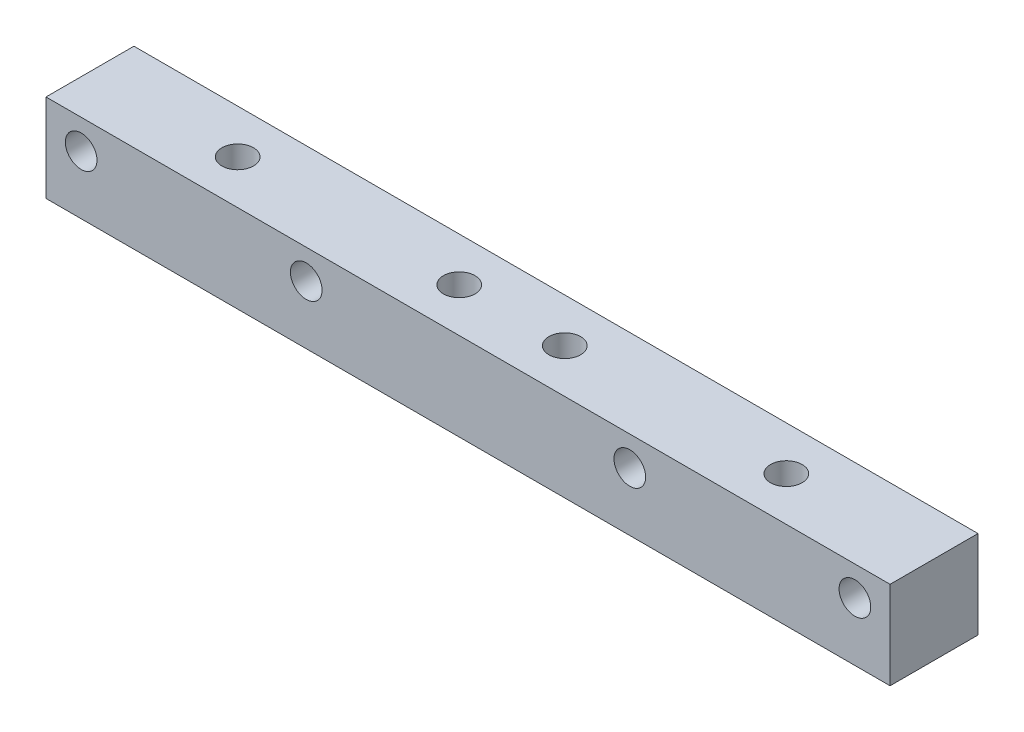
ISO-10303-21;
HEADER;
FILE_DESCRIPTION(('STEP AP214'),'2;1');
FILE_NAME('part.step','',(''),(''),'','','');
FILE_SCHEMA(('AUTOMOTIVE_DESIGN { 1 0 10303 214 1 1 1 1 }'));
ENDSEC;
DATA;
#1=APPLICATION_CONTEXT('core data for automotive mechanical design processes');
#2=APPLICATION_PROTOCOL_DEFINITION('international standard','automotive_design',2000,#1);
#3=PRODUCT_CONTEXT('',#1,'mechanical');
#4=PRODUCT('Part','Part','',(#3));
#5=PRODUCT_RELATED_PRODUCT_CATEGORY('part','',(#4));
#6=PRODUCT_DEFINITION_FORMATION('','',#4);
#7=PRODUCT_DEFINITION_CONTEXT('part definition',#1,'design');
#8=PRODUCT_DEFINITION('design','',#6,#7);
#9=PRODUCT_DEFINITION_SHAPE('','',#8);
#10=(LENGTH_UNIT() NAMED_UNIT(*) SI_UNIT(.MILLI.,.METRE.));
#11=(NAMED_UNIT(*) PLANE_ANGLE_UNIT() SI_UNIT($,.RADIAN.));
#12=(NAMED_UNIT(*) SI_UNIT($,.STERADIAN.) SOLID_ANGLE_UNIT());
#13=UNCERTAINTY_MEASURE_WITH_UNIT(LENGTH_MEASURE(1.E-05),#10,'distance_accuracy_value','');
#14=(GEOMETRIC_REPRESENTATION_CONTEXT(3) GLOBAL_UNCERTAINTY_ASSIGNED_CONTEXT((#13)) GLOBAL_UNIT_ASSIGNED_CONTEXT((#10,
#11,#12)) REPRESENTATION_CONTEXT('',''));
#15=CARTESIAN_POINT('',(0.,0.,0.));
#16=DIRECTION('',(0.,0.,1.));
#17=DIRECTION('',(1.,0.,0.));
#18=AXIS2_PLACEMENT_3D('',#15,#16,#17);
#19=CARTESIAN_POINT('',(60.,-6.25,-6.25));
#20=DIRECTION('',(0.,0.,1.));
#21=DIRECTION('',(1.,0.,0.));
#22=AXIS2_PLACEMENT_3D('',#19,#20,#21);
#23=PLANE('',#22);
#24=CARTESIAN_POINT('',(-55.,2.07,-6.25));
#25=DIRECTION('',(0.,0.,1.));
#26=DIRECTION('',(1.,0.,0.));
#27=AXIS2_PLACEMENT_3D('',#24,#25,#26);
#28=CIRCLE('',#27,2.24999999999999);
#29=CARTESIAN_POINT('',(-52.75,2.07,-6.25));
#30=VERTEX_POINT('',#29);
#31=EDGE_CURVE('E167',#30,#30,#28,.T.);
#32=ORIENTED_EDGE('',*,*,#31,.T.);
#33=EDGE_LOOP('',(#32));
#34=FACE_BOUND('',#33,.T.);
#35=CARTESIAN_POINT('',(-23.,2.07,-6.25));
#36=DIRECTION('',(0.,0.,1.));
#37=DIRECTION('',(1.,0.,0.));
#38=AXIS2_PLACEMENT_3D('',#35,#36,#37);
#39=CIRCLE('',#38,2.24999999999999);
#40=CARTESIAN_POINT('',(-20.75,2.07,-6.25));
#41=VERTEX_POINT('',#40);
#42=EDGE_CURVE('E159',#41,#41,#39,.T.);
#43=ORIENTED_EDGE('',*,*,#42,.T.);
#44=EDGE_LOOP('',(#43));
#45=FACE_BOUND('',#44,.T.);
#46=CARTESIAN_POINT('',(23.,2.07,-6.25));
#47=DIRECTION('',(0.,0.,1.));
#48=DIRECTION('',(1.,0.,0.));
#49=AXIS2_PLACEMENT_3D('',#46,#47,#48);
#50=CIRCLE('',#49,2.24999999999999);
#51=CARTESIAN_POINT('',(25.25,2.07,-6.25));
#52=VERTEX_POINT('',#51);
#53=EDGE_CURVE('E151',#52,#52,#50,.T.);
#54=ORIENTED_EDGE('',*,*,#53,.T.);
#55=EDGE_LOOP('',(#54));
#56=FACE_BOUND('',#55,.T.);
#57=CARTESIAN_POINT('',(55.,2.07,-6.25));
#58=DIRECTION('',(0.,0.,1.));
#59=DIRECTION('',(1.,0.,0.));
#60=AXIS2_PLACEMENT_3D('',#57,#58,#59);
#61=CIRCLE('',#60,2.24999999999999);
#62=CARTESIAN_POINT('',(57.25,2.07,-6.25));
#63=VERTEX_POINT('',#62);
#64=EDGE_CURVE('E125',#63,#63,#61,.T.);
#65=ORIENTED_EDGE('',*,*,#64,.T.);
#66=EDGE_LOOP('',(#65));
#67=FACE_BOUND('',#66,.T.);
#68=DIRECTION('',(0.,1.,0.));
#69=VECTOR('',#68,1.);
#70=CARTESIAN_POINT('',(-60.,-6.25,-6.25));
#71=LINE('',#70,#69);
#72=CARTESIAN_POINT('',(-60.,-6.25,-6.25));
#73=VERTEX_POINT('',#72);
#74=CARTESIAN_POINT('',(-60.,6.25,-6.25));
#75=VERTEX_POINT('',#74);
#76=EDGE_CURVE('E121',#73,#75,#71,.T.);
#77=ORIENTED_EDGE('',*,*,#76,.T.);
#78=DIRECTION('',(-1.,0.,0.));
#79=VECTOR('',#78,1.);
#80=CARTESIAN_POINT('',(60.,6.25,-6.25));
#81=LINE('',#80,#79);
#82=CARTESIAN_POINT('',(60.,6.25,-6.25));
#83=VERTEX_POINT('',#82);
#84=EDGE_CURVE('E13',#83,#75,#81,.T.);
#85=ORIENTED_EDGE('',*,*,#84,.F.);
#86=DIRECTION('',(0.,1.,0.));
#87=VECTOR('',#86,1.);
#88=CARTESIAN_POINT('',(60.,-6.25,-6.25));
#89=LINE('',#88,#87);
#90=CARTESIAN_POINT('',(60.,-6.25,-6.25));
#91=VERTEX_POINT('',#90);
#92=EDGE_CURVE('E104',#91,#83,#89,.T.);
#93=ORIENTED_EDGE('',*,*,#92,.F.);
#94=DIRECTION('',(-1.,0.,0.));
#95=VECTOR('',#94,1.);
#96=CARTESIAN_POINT('',(60.,-6.25,-6.25));
#97=LINE('',#96,#95);
#98=EDGE_CURVE('E117',#91,#73,#97,.T.);
#99=ORIENTED_EDGE('',*,*,#98,.T.);
#100=EDGE_LOOP('',(#77,#85,#93,#99));
#101=FACE_BOUND('',#100,.T.);
#102=ADVANCED_FACE('F52',(#34,#45,#56,#67,#101),#23,.F.);
#103=CARTESIAN_POINT('',(60.,6.25,6.25));
#104=DIRECTION('',(0.,-1.,0.));
#105=DIRECTION('',(0.,0.,-1.));
#106=AXIS2_PLACEMENT_3D('',#103,#104,#105);
#107=PLANE('',#106);
#108=CARTESIAN_POINT('',(-39.,6.25,0.));
#109=DIRECTION('',(0.,1.,0.));
#110=DIRECTION('',(0.,0.,1.));
#111=AXIS2_PLACEMENT_3D('',#108,#109,#110);
#112=CIRCLE('',#111,2.25);
#113=CARTESIAN_POINT('',(-39.,6.25,2.25));
#114=VERTEX_POINT('',#113);
#115=EDGE_CURVE('E203',#114,#114,#112,.T.);
#116=ORIENTED_EDGE('',*,*,#115,.F.);
#117=EDGE_LOOP('',(#116));
#118=FACE_BOUND('',#117,.T.);
#119=CARTESIAN_POINT('',(39.,6.25,0.));
#120=DIRECTION('',(0.,1.,0.));
#121=DIRECTION('',(0.,0.,1.));
#122=AXIS2_PLACEMENT_3D('',#119,#120,#121);
#123=CIRCLE('',#122,2.25);
#124=CARTESIAN_POINT('',(39.,6.25,2.25));
#125=VERTEX_POINT('',#124);
#126=EDGE_CURVE('E195',#125,#125,#123,.T.);
#127=ORIENTED_EDGE('',*,*,#126,.F.);
#128=EDGE_LOOP('',(#127));
#129=FACE_BOUND('',#128,.T.);
#130=CARTESIAN_POINT('',(-7.5,6.25,0.));
#131=DIRECTION('',(0.,1.,0.));
#132=DIRECTION('',(0.,0.,1.));
#133=AXIS2_PLACEMENT_3D('',#130,#131,#132);
#134=CIRCLE('',#133,2.25);
#135=CARTESIAN_POINT('',(-7.5,6.25,2.25));
#136=VERTEX_POINT('',#135);
#137=EDGE_CURVE('E187',#136,#136,#134,.T.);
#138=ORIENTED_EDGE('',*,*,#137,.F.);
#139=EDGE_LOOP('',(#138));
#140=FACE_BOUND('',#139,.T.);
#141=CARTESIAN_POINT('',(7.5,6.25,0.));
#142=DIRECTION('',(0.,1.,0.));
#143=DIRECTION('',(0.,0.,1.));
#144=AXIS2_PLACEMENT_3D('',#141,#142,#143);
#145=CIRCLE('',#144,2.25);
#146=CARTESIAN_POINT('',(7.5,6.25,2.25));
#147=VERTEX_POINT('',#146);
#148=EDGE_CURVE('E179',#147,#147,#145,.T.);
#149=ORIENTED_EDGE('',*,*,#148,.F.);
#150=EDGE_LOOP('',(#149));
#151=FACE_BOUND('',#150,.T.);
#152=DIRECTION('',(0.,0.,1.));
#153=VECTOR('',#152,1.);
#154=CARTESIAN_POINT('',(-60.,6.25,6.25));
#155=LINE('',#154,#153);
#156=CARTESIAN_POINT('',(-60.,6.25,6.25));
#157=VERTEX_POINT('',#156);
#158=EDGE_CURVE('E109',#75,#157,#155,.T.);
#159=ORIENTED_EDGE('',*,*,#158,.T.);
#160=DIRECTION('',(-1.,0.,0.));
#161=VECTOR('',#160,1.);
#162=CARTESIAN_POINT('',(60.,6.25,6.25));
#163=LINE('',#162,#161);
#164=CARTESIAN_POINT('',(60.,6.25,6.25));
#165=VERTEX_POINT('',#164);
#166=EDGE_CURVE('E61',#165,#157,#163,.T.);
#167=ORIENTED_EDGE('',*,*,#166,.F.);
#168=DIRECTION('',(0.,0.,1.));
#169=VECTOR('',#168,1.);
#170=CARTESIAN_POINT('',(60.,6.25,6.25));
#171=LINE('',#170,#169);
#172=EDGE_CURVE('E99',#83,#165,#171,.T.);
#173=ORIENTED_EDGE('',*,*,#172,.F.);
#174=ORIENTED_EDGE('',*,*,#84,.T.);
#175=EDGE_LOOP('',(#159,#167,#173,#174));
#176=FACE_BOUND('',#175,.T.);
#177=ADVANCED_FACE('F108',(#118,#129,#140,#151,#176),#107,.F.);
#178=CARTESIAN_POINT('',(60.,-6.25,6.25));
#179=DIRECTION('',(0.,0.,-1.));
#180=DIRECTION('',(-1.,0.,0.));
#181=AXIS2_PLACEMENT_3D('',#178,#179,#180);
#182=PLANE('',#181);
#183=CARTESIAN_POINT('',(-55.,2.07,6.25));
#184=DIRECTION('',(0.,0.,1.));
#185=DIRECTION('',(1.,0.,0.));
#186=AXIS2_PLACEMENT_3D('',#183,#184,#185);
#187=CIRCLE('',#186,2.24999999999999);
#188=CARTESIAN_POINT('',(-52.75,2.07,6.25));
#189=VERTEX_POINT('',#188);
#190=EDGE_CURVE('E171',#189,#189,#187,.T.);
#191=ORIENTED_EDGE('',*,*,#190,.F.);
#192=EDGE_LOOP('',(#191));
#193=FACE_BOUND('',#192,.T.);
#194=CARTESIAN_POINT('',(-23.,2.07,6.25));
#195=DIRECTION('',(0.,0.,1.));
#196=DIRECTION('',(1.,0.,0.));
#197=AXIS2_PLACEMENT_3D('',#194,#195,#196);
#198=CIRCLE('',#197,2.24999999999999);
#199=CARTESIAN_POINT('',(-20.75,2.07,6.25));
#200=VERTEX_POINT('',#199);
#201=EDGE_CURVE('E163',#200,#200,#198,.T.);
#202=ORIENTED_EDGE('',*,*,#201,.F.);
#203=EDGE_LOOP('',(#202));
#204=FACE_BOUND('',#203,.T.);
#205=CARTESIAN_POINT('',(23.,2.07,6.25));
#206=DIRECTION('',(0.,0.,1.));
#207=DIRECTION('',(1.,0.,0.));
#208=AXIS2_PLACEMENT_3D('',#205,#206,#207);
#209=CIRCLE('',#208,2.24999999999999);
#210=CARTESIAN_POINT('',(25.25,2.07,6.25));
#211=VERTEX_POINT('',#210);
#212=EDGE_CURVE('E155',#211,#211,#209,.T.);
#213=ORIENTED_EDGE('',*,*,#212,.F.);
#214=EDGE_LOOP('',(#213));
#215=FACE_BOUND('',#214,.T.);
#216=CARTESIAN_POINT('',(55.,2.07,6.25));
#217=DIRECTION('',(0.,0.,1.));
#218=DIRECTION('',(1.,0.,0.));
#219=AXIS2_PLACEMENT_3D('',#216,#217,#218);
#220=CIRCLE('',#219,2.24999999999999);
#221=CARTESIAN_POINT('',(57.25,2.07,6.25));
#222=VERTEX_POINT('',#221);
#223=EDGE_CURVE('E147',#222,#222,#220,.T.);
#224=ORIENTED_EDGE('',*,*,#223,.F.);
#225=EDGE_LOOP('',(#224));
#226=FACE_BOUND('',#225,.T.);
#227=DIRECTION('',(0.,-1.,0.));
#228=VECTOR('',#227,1.);
#229=CARTESIAN_POINT('',(-60.,-6.25,6.25));
#230=LINE('',#229,#228);
#231=CARTESIAN_POINT('',(-60.,-6.25,6.25));
#232=VERTEX_POINT('',#231);
#233=EDGE_CURVE('E86',#157,#232,#230,.T.);
#234=ORIENTED_EDGE('',*,*,#233,.T.);
#235=DIRECTION('',(-1.,0.,0.));
#236=VECTOR('',#235,1.);
#237=CARTESIAN_POINT('',(60.,-6.25,6.25));
#238=LINE('',#237,#236);
#239=CARTESIAN_POINT('',(60.,-6.25,6.25));
#240=VERTEX_POINT('',#239);
#241=EDGE_CURVE('E111',#240,#232,#238,.T.);
#242=ORIENTED_EDGE('',*,*,#241,.F.);
#243=DIRECTION('',(0.,-1.,0.));
#244=VECTOR('',#243,1.);
#245=CARTESIAN_POINT('',(60.,-6.25,6.25));
#246=LINE('',#245,#244);
#247=EDGE_CURVE('E102',#165,#240,#246,.T.);
#248=ORIENTED_EDGE('',*,*,#247,.F.);
#249=ORIENTED_EDGE('',*,*,#166,.T.);
#250=EDGE_LOOP('',(#234,#242,#248,#249));
#251=FACE_BOUND('',#250,.T.);
#252=ADVANCED_FACE('F112',(#193,#204,#215,#226,#251),#182,.F.);
#253=CARTESIAN_POINT('',(60.,-6.25,6.25));
#254=DIRECTION('',(0.,1.,0.));
#255=DIRECTION('',(0.,0.,1.));
#256=AXIS2_PLACEMENT_3D('',#253,#254,#255);
#257=PLANE('',#256);
#258=CARTESIAN_POINT('',(-39.,-6.25,0.));
#259=DIRECTION('',(0.,1.,0.));
#260=DIRECTION('',(0.,0.,1.));
#261=AXIS2_PLACEMENT_3D('',#258,#259,#260);
#262=CIRCLE('',#261,2.25);
#263=CARTESIAN_POINT('',(-39.,-6.25,2.25));
#264=VERTEX_POINT('',#263);
#265=EDGE_CURVE('E199',#264,#264,#262,.T.);
#266=ORIENTED_EDGE('',*,*,#265,.T.);
#267=EDGE_LOOP('',(#266));
#268=FACE_BOUND('',#267,.T.);
#269=CARTESIAN_POINT('',(39.,-6.25,0.));
#270=DIRECTION('',(0.,1.,0.));
#271=DIRECTION('',(0.,0.,1.));
#272=AXIS2_PLACEMENT_3D('',#269,#270,#271);
#273=CIRCLE('',#272,2.25);
#274=CARTESIAN_POINT('',(39.,-6.25,2.25));
#275=VERTEX_POINT('',#274);
#276=EDGE_CURVE('E191',#275,#275,#273,.T.);
#277=ORIENTED_EDGE('',*,*,#276,.T.);
#278=EDGE_LOOP('',(#277));
#279=FACE_BOUND('',#278,.T.);
#280=CARTESIAN_POINT('',(-7.5,-6.25,0.));
#281=DIRECTION('',(0.,1.,0.));
#282=DIRECTION('',(0.,0.,1.));
#283=AXIS2_PLACEMENT_3D('',#280,#281,#282);
#284=CIRCLE('',#283,2.25);
#285=CARTESIAN_POINT('',(-7.5,-6.25,2.25));
#286=VERTEX_POINT('',#285);
#287=EDGE_CURVE('E183',#286,#286,#284,.T.);
#288=ORIENTED_EDGE('',*,*,#287,.T.);
#289=EDGE_LOOP('',(#288));
#290=FACE_BOUND('',#289,.T.);
#291=CARTESIAN_POINT('',(7.5,-6.25,0.));
#292=DIRECTION('',(0.,1.,0.));
#293=DIRECTION('',(0.,0.,1.));
#294=AXIS2_PLACEMENT_3D('',#291,#292,#293);
#295=CIRCLE('',#294,2.25);
#296=CARTESIAN_POINT('',(7.5,-6.25,2.25));
#297=VERTEX_POINT('',#296);
#298=EDGE_CURVE('E175',#297,#297,#295,.T.);
#299=ORIENTED_EDGE('',*,*,#298,.T.);
#300=EDGE_LOOP('',(#299));
#301=FACE_BOUND('',#300,.T.);
#302=DIRECTION('',(0.,0.,-1.));
#303=VECTOR('',#302,1.);
#304=CARTESIAN_POINT('',(-60.,-6.25,6.25));
#305=LINE('',#304,#303);
#306=EDGE_CURVE('E92',#232,#73,#305,.T.);
#307=ORIENTED_EDGE('',*,*,#306,.T.);
#308=ORIENTED_EDGE('',*,*,#98,.F.);
#309=DIRECTION('',(0.,0.,-1.));
#310=VECTOR('',#309,1.);
#311=CARTESIAN_POINT('',(60.,-6.25,6.25));
#312=LINE('',#311,#310);
#313=EDGE_CURVE('E69',#240,#91,#312,.T.);
#314=ORIENTED_EDGE('',*,*,#313,.F.);
#315=ORIENTED_EDGE('',*,*,#241,.T.);
#316=EDGE_LOOP('',(#307,#308,#314,#315));
#317=FACE_BOUND('',#316,.T.);
#318=ADVANCED_FACE('F136',(#268,#279,#290,#301,#317),#257,.F.);
#319=CARTESIAN_POINT('',(60.,0.,0.));
#320=DIRECTION('',(-1.,0.,0.));
#321=DIRECTION('',(0.,0.,1.));
#322=AXIS2_PLACEMENT_3D('',#319,#320,#321);
#323=PLANE('',#322);
#324=ORIENTED_EDGE('',*,*,#92,.T.);
#325=ORIENTED_EDGE('',*,*,#172,.T.);
#326=ORIENTED_EDGE('',*,*,#247,.T.);
#327=ORIENTED_EDGE('',*,*,#313,.T.);
#328=EDGE_LOOP('',(#324,#325,#326,#327));
#329=FACE_BOUND('',#328,.T.);
#330=ADVANCED_FACE('F100',(#329),#323,.F.);
#331=CARTESIAN_POINT('',(-60.,0.,0.));
#332=DIRECTION('',(-1.,0.,0.));
#333=DIRECTION('',(0.,0.,1.));
#334=AXIS2_PLACEMENT_3D('',#331,#332,#333);
#335=PLANE('',#334);
#336=ORIENTED_EDGE('',*,*,#76,.F.);
#337=ORIENTED_EDGE('',*,*,#306,.F.);
#338=ORIENTED_EDGE('',*,*,#233,.F.);
#339=ORIENTED_EDGE('',*,*,#158,.F.);
#340=EDGE_LOOP('',(#336,#337,#338,#339));
#341=FACE_BOUND('',#340,.T.);
#342=ADVANCED_FACE('F139',(#341),#335,.T.);
#343=CARTESIAN_POINT('',(55.,2.07,6.25));
#344=DIRECTION('',(0.,0.,1.));
#345=DIRECTION('',(1.,0.,0.));
#346=AXIS2_PLACEMENT_3D('',#343,#344,#345);
#347=CYLINDRICAL_SURFACE('',#346,2.24999999999999);
#348=ORIENTED_EDGE('',*,*,#64,.F.);
#349=EDGE_LOOP('',(#348));
#350=FACE_BOUND('',#349,.T.);
#351=ORIENTED_EDGE('',*,*,#223,.T.);
#352=EDGE_LOOP('',(#351));
#353=FACE_BOUND('',#352,.T.);
#354=ADVANCED_FACE('F248',(#350,#353),#347,.F.);
#355=CARTESIAN_POINT('',(23.,2.07,6.25));
#356=DIRECTION('',(0.,0.,1.));
#357=DIRECTION('',(1.,0.,0.));
#358=AXIS2_PLACEMENT_3D('',#355,#356,#357);
#359=CYLINDRICAL_SURFACE('',#358,2.24999999999999);
#360=ORIENTED_EDGE('',*,*,#53,.F.);
#361=EDGE_LOOP('',(#360));
#362=FACE_BOUND('',#361,.T.);
#363=ORIENTED_EDGE('',*,*,#212,.T.);
#364=EDGE_LOOP('',(#363));
#365=FACE_BOUND('',#364,.T.);
#366=ADVANCED_FACE('F251',(#362,#365),#359,.F.);
#367=CARTESIAN_POINT('',(-23.,2.07,6.25));
#368=DIRECTION('',(0.,0.,1.));
#369=DIRECTION('',(1.,0.,0.));
#370=AXIS2_PLACEMENT_3D('',#367,#368,#369);
#371=CYLINDRICAL_SURFACE('',#370,2.24999999999999);
#372=ORIENTED_EDGE('',*,*,#42,.F.);
#373=EDGE_LOOP('',(#372));
#374=FACE_BOUND('',#373,.T.);
#375=ORIENTED_EDGE('',*,*,#201,.T.);
#376=EDGE_LOOP('',(#375));
#377=FACE_BOUND('',#376,.T.);
#378=ADVANCED_FACE('F232',(#374,#377),#371,.F.);
#379=CARTESIAN_POINT('',(-55.,2.07,6.25));
#380=DIRECTION('',(0.,0.,1.));
#381=DIRECTION('',(1.,0.,0.));
#382=AXIS2_PLACEMENT_3D('',#379,#380,#381);
#383=CYLINDRICAL_SURFACE('',#382,2.24999999999999);
#384=ORIENTED_EDGE('',*,*,#31,.F.);
#385=EDGE_LOOP('',(#384));
#386=FACE_BOUND('',#385,.T.);
#387=ORIENTED_EDGE('',*,*,#190,.T.);
#388=EDGE_LOOP('',(#387));
#389=FACE_BOUND('',#388,.T.);
#390=ADVANCED_FACE('F222',(#386,#389),#383,.F.);
#391=CARTESIAN_POINT('',(7.5,6.25,0.));
#392=DIRECTION('',(0.,1.,0.));
#393=DIRECTION('',(0.,0.,1.));
#394=AXIS2_PLACEMENT_3D('',#391,#392,#393);
#395=CYLINDRICAL_SURFACE('',#394,2.25);
#396=ORIENTED_EDGE('',*,*,#298,.F.);
#397=EDGE_LOOP('',(#396));
#398=FACE_BOUND('',#397,.T.);
#399=ORIENTED_EDGE('',*,*,#148,.T.);
#400=EDGE_LOOP('',(#399));
#401=FACE_BOUND('',#400,.T.);
#402=ADVANCED_FACE('F219',(#398,#401),#395,.F.);
#403=CARTESIAN_POINT('',(-7.5,6.25,0.));
#404=DIRECTION('',(0.,1.,0.));
#405=DIRECTION('',(0.,0.,1.));
#406=AXIS2_PLACEMENT_3D('',#403,#404,#405);
#407=CYLINDRICAL_SURFACE('',#406,2.25);
#408=ORIENTED_EDGE('',*,*,#287,.F.);
#409=EDGE_LOOP('',(#408));
#410=FACE_BOUND('',#409,.T.);
#411=ORIENTED_EDGE('',*,*,#137,.T.);
#412=EDGE_LOOP('',(#411));
#413=FACE_BOUND('',#412,.T.);
#414=ADVANCED_FACE('F221',(#410,#413),#407,.F.);
#415=CARTESIAN_POINT('',(39.,6.25,0.));
#416=DIRECTION('',(0.,1.,0.));
#417=DIRECTION('',(0.,0.,1.));
#418=AXIS2_PLACEMENT_3D('',#415,#416,#417);
#419=CYLINDRICAL_SURFACE('',#418,2.25);
#420=ORIENTED_EDGE('',*,*,#276,.F.);
#421=EDGE_LOOP('',(#420));
#422=FACE_BOUND('',#421,.T.);
#423=ORIENTED_EDGE('',*,*,#126,.T.);
#424=EDGE_LOOP('',(#423));
#425=FACE_BOUND('',#424,.T.);
#426=ADVANCED_FACE('F229',(#422,#425),#419,.F.);
#427=CARTESIAN_POINT('',(-39.,6.25,0.));
#428=DIRECTION('',(0.,1.,0.));
#429=DIRECTION('',(0.,0.,1.));
#430=AXIS2_PLACEMENT_3D('',#427,#428,#429);
#431=CYLINDRICAL_SURFACE('',#430,2.25);
#432=ORIENTED_EDGE('',*,*,#265,.F.);
#433=EDGE_LOOP('',(#432));
#434=FACE_BOUND('',#433,.T.);
#435=ORIENTED_EDGE('',*,*,#115,.T.);
#436=EDGE_LOOP('',(#435));
#437=FACE_BOUND('',#436,.T.);
#438=ADVANCED_FACE('F209',(#434,#437),#431,.F.);
#439=CLOSED_SHELL('',(#102,#177,#252,#318,#330,#342,#354,#366,#378,#390,#402,#414,#426,#438));
#440=MANIFOLD_SOLID_BREP('B2',#439);
#441=ADVANCED_BREP_SHAPE_REPRESENTATION('',(#18,#440),#14);
#442=SHAPE_DEFINITION_REPRESENTATION(#9,#441);
ENDSEC;
END-ISO-10303-21;
